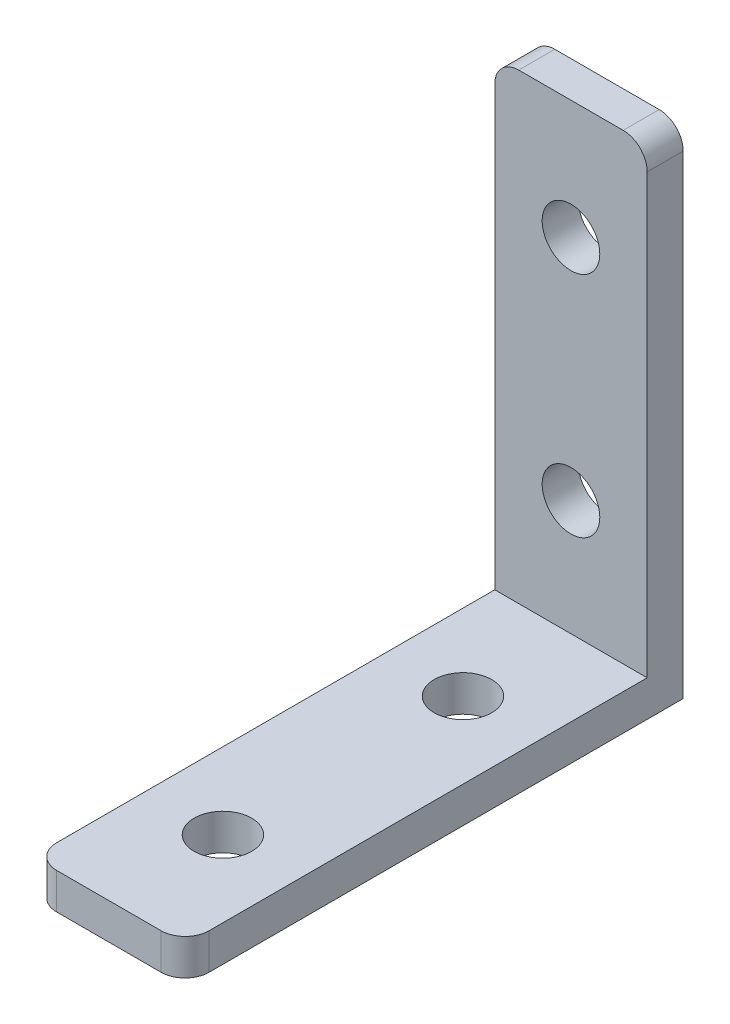
ISO-10303-21;
HEADER;
FILE_DESCRIPTION(('STEP AP214'),'2;1');
FILE_NAME('part.step','',(''),(''),'','','');
FILE_SCHEMA(('AUTOMOTIVE_DESIGN { 1 0 10303 214 1 1 1 1 }'));
ENDSEC;
DATA;
#1=APPLICATION_CONTEXT('core data for automotive mechanical design processes');
#2=APPLICATION_PROTOCOL_DEFINITION('international standard','automotive_design',2000,#1);
#3=PRODUCT_CONTEXT('',#1,'mechanical');
#4=PRODUCT('Part','Part','',(#3));
#5=PRODUCT_RELATED_PRODUCT_CATEGORY('part','',(#4));
#6=PRODUCT_DEFINITION_FORMATION('','',#4);
#7=PRODUCT_DEFINITION_CONTEXT('part definition',#1,'design');
#8=PRODUCT_DEFINITION('design','',#6,#7);
#9=PRODUCT_DEFINITION_SHAPE('','',#8);
#10=(LENGTH_UNIT() NAMED_UNIT(*) SI_UNIT(.MILLI.,.METRE.));
#11=(NAMED_UNIT(*) PLANE_ANGLE_UNIT() SI_UNIT($,.RADIAN.));
#12=(NAMED_UNIT(*) SI_UNIT($,.STERADIAN.) SOLID_ANGLE_UNIT());
#13=UNCERTAINTY_MEASURE_WITH_UNIT(LENGTH_MEASURE(1.E-05),#10,'distance_accuracy_value','');
#14=(GEOMETRIC_REPRESENTATION_CONTEXT(3) GLOBAL_UNCERTAINTY_ASSIGNED_CONTEXT((#13)) GLOBAL_UNIT_ASSIGNED_CONTEXT((#10,
#11,#12)) REPRESENTATION_CONTEXT('',''));
#15=CARTESIAN_POINT('',(0.,0.,0.));
#16=DIRECTION('',(0.,0.,1.));
#17=DIRECTION('',(1.,0.,0.));
#18=AXIS2_PLACEMENT_3D('',#15,#16,#17);
#19=CARTESIAN_POINT('',(0.,0.,3.));
#20=DIRECTION('',(0.,0.,-1.));
#21=DIRECTION('',(-1.,0.,0.));
#22=AXIS2_PLACEMENT_3D('',#19,#20,#21);
#23=PLANE('',#22);
#24=CARTESIAN_POINT('',(0.,-8.15,3.));
#25=DIRECTION('',(0.,0.,1.));
#26=DIRECTION('',(1.,0.,0.));
#27=AXIS2_PLACEMENT_3D('',#24,#25,#26);
#28=CIRCLE('',#27,2.4);
#29=CARTESIAN_POINT('',(2.4,-8.15,3.));
#30=VERTEX_POINT('',#29);
#31=EDGE_CURVE('E153',#30,#30,#28,.T.);
#32=ORIENTED_EDGE('',*,*,#31,.F.);
#33=EDGE_LOOP('',(#32));
#34=FACE_BOUND('',#33,.T.);
#35=CARTESIAN_POINT('',(0.,10.85,3.));
#36=DIRECTION('',(0.,0.,1.));
#37=DIRECTION('',(1.,0.,0.));
#38=AXIS2_PLACEMENT_3D('',#35,#36,#37);
#39=CIRCLE('',#38,2.4);
#40=CARTESIAN_POINT('',(2.4,10.85,3.));
#41=VERTEX_POINT('',#40);
#42=EDGE_CURVE('E159',#41,#41,#39,.T.);
#43=ORIENTED_EDGE('',*,*,#42,.F.);
#44=EDGE_LOOP('',(#43));
#45=FACE_BOUND('',#44,.T.);
#46=DIRECTION('',(-1.,0.,0.));
#47=VECTOR('',#46,1.);
#48=CARTESIAN_POINT('',(-6.35,20.75,3.));
#49=LINE('',#48,#47);
#50=CARTESIAN_POINT('',(4.35,20.75,3.));
#51=VERTEX_POINT('',#50);
#52=CARTESIAN_POINT('',(-4.35,20.75,3.));
#53=VERTEX_POINT('',#52);
#54=EDGE_CURVE('E128',#51,#53,#49,.T.);
#55=ORIENTED_EDGE('',*,*,#54,.T.);
#56=CARTESIAN_POINT('',(-4.35,18.75,3.));
#57=DIRECTION('',(0.,0.,-1.));
#58=DIRECTION('',(-1.,0.,0.));
#59=AXIS2_PLACEMENT_3D('',#56,#57,#58);
#60=CIRCLE('',#59,2.);
#61=CARTESIAN_POINT('',(-6.35,18.75,3.));
#62=VERTEX_POINT('',#61);
#63=EDGE_CURVE('E123',#53,#62,#60,.F.);
#64=ORIENTED_EDGE('',*,*,#63,.T.);
#65=DIRECTION('',(0.,-1.,0.));
#66=VECTOR('',#65,1.);
#67=CARTESIAN_POINT('',(-6.35,-20.75,3.));
#68=LINE('',#67,#66);
#69=CARTESIAN_POINT('',(-6.35,-17.75,3.));
#70=VERTEX_POINT('',#69);
#71=EDGE_CURVE('E115',#62,#70,#68,.T.);
#72=ORIENTED_EDGE('',*,*,#71,.T.);
#73=DIRECTION('',(-1.,0.,0.));
#74=VECTOR('',#73,1.);
#75=CARTESIAN_POINT('',(6.35,-17.75,3.));
#76=LINE('',#75,#74);
#77=CARTESIAN_POINT('',(6.35,-17.75,3.));
#78=VERTEX_POINT('',#77);
#79=EDGE_CURVE('E120',#78,#70,#76,.T.);
#80=ORIENTED_EDGE('',*,*,#79,.F.);
#81=DIRECTION('',(0.,1.,0.));
#82=VECTOR('',#81,1.);
#83=CARTESIAN_POINT('',(6.35,-20.75,3.));
#84=LINE('',#83,#82);
#85=CARTESIAN_POINT('',(6.35,18.75,3.));
#86=VERTEX_POINT('',#85);
#87=EDGE_CURVE('E165',#78,#86,#84,.T.);
#88=ORIENTED_EDGE('',*,*,#87,.T.);
#89=CARTESIAN_POINT('',(4.35,18.75,3.));
#90=DIRECTION('',(0.,0.,-1.));
#91=DIRECTION('',(-1.,0.,0.));
#92=AXIS2_PLACEMENT_3D('',#89,#90,#91);
#93=CIRCLE('',#92,2.);
#94=EDGE_CURVE('E194',#86,#51,#93,.F.);
#95=ORIENTED_EDGE('',*,*,#94,.T.);
#96=EDGE_LOOP('',(#55,#64,#72,#80,#88,#95));
#97=FACE_BOUND('',#96,.T.);
#98=ADVANCED_FACE('F37',(#34,#45,#97),#23,.F.);
#99=CARTESIAN_POINT('',(0.,0.,0.));
#100=DIRECTION('',(0.,0.,-1.));
#101=DIRECTION('',(-1.,0.,0.));
#102=AXIS2_PLACEMENT_3D('',#99,#100,#101);
#103=PLANE('',#102);
#104=CARTESIAN_POINT('',(0.,10.85,0.));
#105=DIRECTION('',(0.,0.,1.));
#106=DIRECTION('',(1.,0.,0.));
#107=AXIS2_PLACEMENT_3D('',#104,#105,#106);
#108=CIRCLE('',#107,2.4);
#109=CARTESIAN_POINT('',(2.4,10.85,0.));
#110=VERTEX_POINT('',#109);
#111=EDGE_CURVE('E156',#110,#110,#108,.T.);
#112=ORIENTED_EDGE('',*,*,#111,.T.);
#113=EDGE_LOOP('',(#112));
#114=FACE_BOUND('',#113,.T.);
#115=DIRECTION('',(0.,-1.,0.));
#116=VECTOR('',#115,1.);
#117=CARTESIAN_POINT('',(-6.35,-20.75,0.));
#118=LINE('',#117,#116);
#119=CARTESIAN_POINT('',(-6.35,18.75,0.));
#120=VERTEX_POINT('',#119);
#121=CARTESIAN_POINT('',(-6.35,-20.75,0.));
#122=VERTEX_POINT('',#121);
#123=EDGE_CURVE('E174',#120,#122,#118,.T.);
#124=ORIENTED_EDGE('',*,*,#123,.F.);
#125=CARTESIAN_POINT('',(-4.35,18.75,0.));
#126=DIRECTION('',(0.,0.,-1.));
#127=DIRECTION('',(-1.,0.,0.));
#128=AXIS2_PLACEMENT_3D('',#125,#126,#127);
#129=CIRCLE('',#128,2.);
#130=CARTESIAN_POINT('',(-4.35,20.75,0.));
#131=VERTEX_POINT('',#130);
#132=EDGE_CURVE('E187',#120,#131,#129,.T.);
#133=ORIENTED_EDGE('',*,*,#132,.T.);
#134=DIRECTION('',(-1.,0.,0.));
#135=VECTOR('',#134,1.);
#136=CARTESIAN_POINT('',(-6.35,20.75,0.));
#137=LINE('',#136,#135);
#138=CARTESIAN_POINT('',(4.35,20.75,0.));
#139=VERTEX_POINT('',#138);
#140=EDGE_CURVE('E171',#139,#131,#137,.T.);
#141=ORIENTED_EDGE('',*,*,#140,.F.);
#142=CARTESIAN_POINT('',(4.35,18.75,0.));
#143=DIRECTION('',(0.,0.,-1.));
#144=DIRECTION('',(-1.,0.,0.));
#145=AXIS2_PLACEMENT_3D('',#142,#143,#144);
#146=CIRCLE('',#145,2.);
#147=CARTESIAN_POINT('',(6.35,18.75,0.));
#148=VERTEX_POINT('',#147);
#149=EDGE_CURVE('E185',#139,#148,#146,.T.);
#150=ORIENTED_EDGE('',*,*,#149,.T.);
#151=DIRECTION('',(0.,1.,0.));
#152=VECTOR('',#151,1.);
#153=CARTESIAN_POINT('',(6.35,-20.75,0.));
#154=LINE('',#153,#152);
#155=CARTESIAN_POINT('',(6.35,-20.75,0.));
#156=VERTEX_POINT('',#155);
#157=EDGE_CURVE('E162',#156,#148,#154,.T.);
#158=ORIENTED_EDGE('',*,*,#157,.F.);
#159=DIRECTION('',(1.,0.,0.));
#160=VECTOR('',#159,1.);
#161=CARTESIAN_POINT('',(-6.35,-20.75,0.));
#162=LINE('',#161,#160);
#163=EDGE_CURVE('E167',#122,#156,#162,.T.);
#164=ORIENTED_EDGE('',*,*,#163,.F.);
#165=EDGE_LOOP('',(#124,#133,#141,#150,#158,#164));
#166=FACE_BOUND('',#165,.T.);
#167=CARTESIAN_POINT('',(0.,-8.15,0.));
#168=DIRECTION('',(0.,0.,1.));
#169=DIRECTION('',(1.,0.,0.));
#170=AXIS2_PLACEMENT_3D('',#167,#168,#169);
#171=CIRCLE('',#170,2.4);
#172=CARTESIAN_POINT('',(2.4,-8.15,0.));
#173=VERTEX_POINT('',#172);
#174=EDGE_CURVE('E151',#173,#173,#171,.T.);
#175=ORIENTED_EDGE('',*,*,#174,.T.);
#176=EDGE_LOOP('',(#175));
#177=FACE_BOUND('',#176,.T.);
#178=ADVANCED_FACE('F231',(#114,#166,#177),#103,.T.);
#179=CARTESIAN_POINT('',(6.35,-20.75,3.));
#180=DIRECTION('',(-1.,0.,0.));
#181=DIRECTION('',(0.,0.,1.));
#182=AXIS2_PLACEMENT_3D('',#179,#180,#181);
#183=PLANE('',#182);
#184=ORIENTED_EDGE('',*,*,#157,.T.);
#185=DIRECTION('',(0.,0.,-1.));
#186=VECTOR('',#185,1.);
#187=CARTESIAN_POINT('',(6.35,18.75,3.));
#188=LINE('',#187,#186);
#189=EDGE_CURVE('E200',#148,#86,#188,.F.);
#190=ORIENTED_EDGE('',*,*,#189,.T.);
#191=ORIENTED_EDGE('',*,*,#87,.F.);
#192=DIRECTION('',(0.,0.,-1.));
#193=VECTOR('',#192,1.);
#194=CARTESIAN_POINT('',(6.35,-17.75,41.5));
#195=LINE('',#194,#193);
#196=CARTESIAN_POINT('',(6.35,-17.75,39.5));
#197=VERTEX_POINT('',#196);
#198=EDGE_CURVE('E137',#197,#78,#195,.T.);
#199=ORIENTED_EDGE('',*,*,#198,.F.);
#200=DIRECTION('',(0.,-1.,0.));
#201=VECTOR('',#200,1.);
#202=CARTESIAN_POINT('',(6.35,-20.75,39.5));
#203=LINE('',#202,#201);
#204=CARTESIAN_POINT('',(6.35,-20.75,39.5));
#205=VERTEX_POINT('',#204);
#206=EDGE_CURVE('E197',#197,#205,#203,.T.);
#207=ORIENTED_EDGE('',*,*,#206,.T.);
#208=DIRECTION('',(0.,0.,-1.));
#209=VECTOR('',#208,1.);
#210=CARTESIAN_POINT('',(6.35,-20.75,3.));
#211=LINE('',#210,#209);
#212=EDGE_CURVE('E127',#205,#156,#211,.T.);
#213=ORIENTED_EDGE('',*,*,#212,.T.);
#214=EDGE_LOOP('',(#184,#190,#191,#199,#207,#213));
#215=FACE_BOUND('',#214,.T.);
#216=ADVANCED_FACE('F214',(#215),#183,.F.);
#217=CARTESIAN_POINT('',(-6.35,20.75,3.));
#218=DIRECTION('',(0.,-1.,0.));
#219=DIRECTION('',(0.,0.,-1.));
#220=AXIS2_PLACEMENT_3D('',#217,#218,#219);
#221=PLANE('',#220);
#222=ORIENTED_EDGE('',*,*,#140,.T.);
#223=DIRECTION('',(0.,0.,-1.));
#224=VECTOR('',#223,1.);
#225=CARTESIAN_POINT('',(-4.35,20.75,3.));
#226=LINE('',#225,#224);
#227=EDGE_CURVE('E192',#131,#53,#226,.F.);
#228=ORIENTED_EDGE('',*,*,#227,.T.);
#229=ORIENTED_EDGE('',*,*,#54,.F.);
#230=DIRECTION('',(0.,0.,-1.));
#231=VECTOR('',#230,1.);
#232=CARTESIAN_POINT('',(4.35,20.75,3.));
#233=LINE('',#232,#231);
#234=EDGE_CURVE('E189',#51,#139,#233,.T.);
#235=ORIENTED_EDGE('',*,*,#234,.T.);
#236=EDGE_LOOP('',(#222,#228,#229,#235));
#237=FACE_BOUND('',#236,.T.);
#238=ADVANCED_FACE('F250',(#237),#221,.F.);
#239=CARTESIAN_POINT('',(-6.35,-20.75,3.));
#240=DIRECTION('',(1.,0.,0.));
#241=DIRECTION('',(0.,0.,-1.));
#242=AXIS2_PLACEMENT_3D('',#239,#240,#241);
#243=PLANE('',#242);
#244=ORIENTED_EDGE('',*,*,#71,.F.);
#245=DIRECTION('',(0.,0.,-1.));
#246=VECTOR('',#245,1.);
#247=CARTESIAN_POINT('',(-6.35,18.75,3.));
#248=LINE('',#247,#246);
#249=EDGE_CURVE('E183',#62,#120,#248,.T.);
#250=ORIENTED_EDGE('',*,*,#249,.T.);
#251=ORIENTED_EDGE('',*,*,#123,.T.);
#252=DIRECTION('',(0.,0.,-1.));
#253=VECTOR('',#252,1.);
#254=CARTESIAN_POINT('',(-6.35,-20.75,3.));
#255=LINE('',#254,#253);
#256=CARTESIAN_POINT('',(-6.35,-20.75,39.5));
#257=VERTEX_POINT('',#256);
#258=EDGE_CURVE('E180',#257,#122,#255,.T.);
#259=ORIENTED_EDGE('',*,*,#258,.F.);
#260=DIRECTION('',(0.,-1.,0.));
#261=VECTOR('',#260,1.);
#262=CARTESIAN_POINT('',(-6.35,-20.75,39.5));
#263=LINE('',#262,#261);
#264=CARTESIAN_POINT('',(-6.35,-17.75,39.5));
#265=VERTEX_POINT('',#264);
#266=EDGE_CURVE('E134',#257,#265,#263,.F.);
#267=ORIENTED_EDGE('',*,*,#266,.T.);
#268=DIRECTION('',(0.,0.,-1.));
#269=VECTOR('',#268,1.);
#270=CARTESIAN_POINT('',(-6.35,-17.75,41.5));
#271=LINE('',#270,#269);
#272=EDGE_CURVE('E131',#265,#70,#271,.T.);
#273=ORIENTED_EDGE('',*,*,#272,.T.);
#274=EDGE_LOOP('',(#244,#250,#251,#259,#267,#273));
#275=FACE_BOUND('',#274,.T.);
#276=ADVANCED_FACE('F132',(#275),#243,.F.);
#277=CARTESIAN_POINT('',(-6.35,-20.75,3.));
#278=DIRECTION('',(0.,1.,0.));
#279=DIRECTION('',(0.,0.,1.));
#280=AXIS2_PLACEMENT_3D('',#277,#278,#279);
#281=PLANE('',#280);
#282=CARTESIAN_POINT('',(0.,-20.75,12.));
#283=DIRECTION('',(0.,1.,0.));
#284=DIRECTION('',(0.,0.,1.));
#285=AXIS2_PLACEMENT_3D('',#282,#283,#284);
#286=CIRCLE('',#285,2.4);
#287=CARTESIAN_POINT('',(0.,-20.75,14.4));
#288=VERTEX_POINT('',#287);
#289=EDGE_CURVE('E143',#288,#288,#286,.T.);
#290=ORIENTED_EDGE('',*,*,#289,.T.);
#291=EDGE_LOOP('',(#290));
#292=FACE_BOUND('',#291,.T.);
#293=CARTESIAN_POINT('',(0.,-20.75,32.));
#294=DIRECTION('',(0.,1.,0.));
#295=DIRECTION('',(0.,0.,1.));
#296=AXIS2_PLACEMENT_3D('',#293,#294,#295);
#297=CIRCLE('',#296,2.4);
#298=CARTESIAN_POINT('',(0.,-20.75,34.4));
#299=VERTEX_POINT('',#298);
#300=EDGE_CURVE('E147',#299,#299,#297,.T.);
#301=ORIENTED_EDGE('',*,*,#300,.T.);
#302=EDGE_LOOP('',(#301));
#303=FACE_BOUND('',#302,.T.);
#304=DIRECTION('',(-1.,0.,0.));
#305=VECTOR('',#304,1.);
#306=CARTESIAN_POINT('',(6.35,-20.75,41.5));
#307=LINE('',#306,#305);
#308=CARTESIAN_POINT('',(4.35,-20.75,41.5));
#309=VERTEX_POINT('',#308);
#310=CARTESIAN_POINT('',(-4.35,-20.75,41.5));
#311=VERTEX_POINT('',#310);
#312=EDGE_CURVE('E142',#309,#311,#307,.T.);
#313=ORIENTED_EDGE('',*,*,#312,.T.);
#314=CARTESIAN_POINT('',(-4.35,-20.75,39.5));
#315=DIRECTION('',(0.,1.,0.));
#316=DIRECTION('',(0.,0.,1.));
#317=AXIS2_PLACEMENT_3D('',#314,#315,#316);
#318=CIRCLE('',#317,2.);
#319=EDGE_CURVE('E52',#311,#257,#318,.F.);
#320=ORIENTED_EDGE('',*,*,#319,.T.);
#321=ORIENTED_EDGE('',*,*,#258,.T.);
#322=ORIENTED_EDGE('',*,*,#163,.T.);
#323=ORIENTED_EDGE('',*,*,#212,.F.);
#324=CARTESIAN_POINT('',(4.35,-20.75,39.5));
#325=DIRECTION('',(0.,1.,0.));
#326=DIRECTION('',(0.,0.,1.));
#327=AXIS2_PLACEMENT_3D('',#324,#325,#326);
#328=CIRCLE('',#327,2.);
#329=EDGE_CURVE('E60',#205,#309,#328,.F.);
#330=ORIENTED_EDGE('',*,*,#329,.T.);
#331=EDGE_LOOP('',(#313,#320,#321,#322,#323,#330));
#332=FACE_BOUND('',#331,.T.);
#333=ADVANCED_FACE('F217',(#292,#303,#332),#281,.F.);
#334=CARTESIAN_POINT('',(0.,10.85,3.));
#335=DIRECTION('',(0.,0.,-1.));
#336=DIRECTION('',(-1.,0.,0.));
#337=AXIS2_PLACEMENT_3D('',#334,#335,#336);
#338=CYLINDRICAL_SURFACE('',#337,2.4);
#339=ORIENTED_EDGE('',*,*,#42,.T.);
#340=EDGE_LOOP('',(#339));
#341=FACE_BOUND('',#340,.T.);
#342=ORIENTED_EDGE('',*,*,#111,.F.);
#343=EDGE_LOOP('',(#342));
#344=FACE_BOUND('',#343,.T.);
#345=ADVANCED_FACE('F242',(#341,#344),#338,.F.);
#346=CARTESIAN_POINT('',(0.,-8.15,3.));
#347=DIRECTION('',(0.,0.,-1.));
#348=DIRECTION('',(-1.,0.,0.));
#349=AXIS2_PLACEMENT_3D('',#346,#347,#348);
#350=CYLINDRICAL_SURFACE('',#349,2.4);
#351=ORIENTED_EDGE('',*,*,#31,.T.);
#352=EDGE_LOOP('',(#351));
#353=FACE_BOUND('',#352,.T.);
#354=ORIENTED_EDGE('',*,*,#174,.F.);
#355=EDGE_LOOP('',(#354));
#356=FACE_BOUND('',#355,.T.);
#357=ADVANCED_FACE('F276',(#353,#356),#350,.F.);
#358=CARTESIAN_POINT('',(6.35,-17.75,41.5));
#359=DIRECTION('',(0.,-1.,0.));
#360=DIRECTION('',(0.,0.,-1.));
#361=AXIS2_PLACEMENT_3D('',#358,#359,#360);
#362=PLANE('',#361);
#363=CARTESIAN_POINT('',(0.,-17.75,12.));
#364=DIRECTION('',(0.,1.,0.));
#365=DIRECTION('',(0.,0.,1.));
#366=AXIS2_PLACEMENT_3D('',#363,#364,#365);
#367=CIRCLE('',#366,2.4);
#368=CARTESIAN_POINT('',(0.,-17.75,14.4));
#369=VERTEX_POINT('',#368);
#370=EDGE_CURVE('E300',#369,#369,#367,.T.);
#371=ORIENTED_EDGE('',*,*,#370,.F.);
#372=EDGE_LOOP('',(#371));
#373=FACE_BOUND('',#372,.T.);
#374=CARTESIAN_POINT('',(0.,-17.75,32.));
#375=DIRECTION('',(0.,1.,0.));
#376=DIRECTION('',(0.,0.,1.));
#377=AXIS2_PLACEMENT_3D('',#374,#375,#376);
#378=CIRCLE('',#377,2.4);
#379=CARTESIAN_POINT('',(0.,-17.75,34.4));
#380=VERTEX_POINT('',#379);
#381=EDGE_CURVE('E296',#380,#380,#378,.T.);
#382=ORIENTED_EDGE('',*,*,#381,.F.);
#383=EDGE_LOOP('',(#382));
#384=FACE_BOUND('',#383,.T.);
#385=ORIENTED_EDGE('',*,*,#272,.F.);
#386=CARTESIAN_POINT('',(-4.35,-17.75,39.5));
#387=DIRECTION('',(0.,-1.,0.));
#388=DIRECTION('',(0.,0.,-1.));
#389=AXIS2_PLACEMENT_3D('',#386,#387,#388);
#390=CIRCLE('',#389,2.);
#391=CARTESIAN_POINT('',(-4.35,-17.75,41.5));
#392=VERTEX_POINT('',#391);
#393=EDGE_CURVE('E11',#265,#392,#390,.F.);
#394=ORIENTED_EDGE('',*,*,#393,.T.);
#395=DIRECTION('',(-1.,0.,0.));
#396=VECTOR('',#395,1.);
#397=CARTESIAN_POINT('',(6.35,-17.75,41.5));
#398=LINE('',#397,#396);
#399=CARTESIAN_POINT('',(4.35,-17.75,41.5));
#400=VERTEX_POINT('',#399);
#401=EDGE_CURVE('E138',#400,#392,#398,.T.);
#402=ORIENTED_EDGE('',*,*,#401,.F.);
#403=CARTESIAN_POINT('',(4.35,-17.75,39.5));
#404=DIRECTION('',(0.,-1.,0.));
#405=DIRECTION('',(0.,0.,-1.));
#406=AXIS2_PLACEMENT_3D('',#403,#404,#405);
#407=CIRCLE('',#406,2.);
#408=EDGE_CURVE('E45',#400,#197,#407,.F.);
#409=ORIENTED_EDGE('',*,*,#408,.T.);
#410=ORIENTED_EDGE('',*,*,#198,.T.);
#411=ORIENTED_EDGE('',*,*,#79,.T.);
#412=EDGE_LOOP('',(#385,#394,#402,#409,#410,#411));
#413=FACE_BOUND('',#412,.T.);
#414=ADVANCED_FACE('F140',(#373,#384,#413),#362,.F.);
#415=CARTESIAN_POINT('',(0.,0.,41.5));
#416=DIRECTION('',(0.,0.,-1.));
#417=DIRECTION('',(-1.,0.,0.));
#418=AXIS2_PLACEMENT_3D('',#415,#416,#417);
#419=PLANE('',#418);
#420=ORIENTED_EDGE('',*,*,#401,.T.);
#421=DIRECTION('',(0.,-1.,0.));
#422=VECTOR('',#421,1.);
#423=CARTESIAN_POINT('',(-4.35,0.,41.5));
#424=LINE('',#423,#422);
#425=EDGE_CURVE('E204',#392,#311,#424,.T.);
#426=ORIENTED_EDGE('',*,*,#425,.T.);
#427=ORIENTED_EDGE('',*,*,#312,.F.);
#428=DIRECTION('',(0.,-1.,0.));
#429=VECTOR('',#428,1.);
#430=CARTESIAN_POINT('',(4.35,0.,41.5));
#431=LINE('',#430,#429);
#432=EDGE_CURVE('E202',#309,#400,#431,.F.);
#433=ORIENTED_EDGE('',*,*,#432,.T.);
#434=EDGE_LOOP('',(#420,#426,#427,#433));
#435=FACE_BOUND('',#434,.T.);
#436=ADVANCED_FACE('F216',(#435),#419,.F.);
#437=CARTESIAN_POINT('',(0.,-59.25,32.));
#438=DIRECTION('',(0.,1.,0.));
#439=DIRECTION('',(0.,0.,1.));
#440=AXIS2_PLACEMENT_3D('',#437,#438,#439);
#441=CYLINDRICAL_SURFACE('',#440,2.4);
#442=ORIENTED_EDGE('',*,*,#381,.T.);
#443=EDGE_LOOP('',(#442));
#444=FACE_BOUND('',#443,.T.);
#445=ORIENTED_EDGE('',*,*,#300,.F.);
#446=EDGE_LOOP('',(#445));
#447=FACE_BOUND('',#446,.T.);
#448=ADVANCED_FACE('F262',(#444,#447),#441,.F.);
#449=CARTESIAN_POINT('',(0.,-59.25,12.));
#450=DIRECTION('',(0.,1.,0.));
#451=DIRECTION('',(0.,0.,1.));
#452=AXIS2_PLACEMENT_3D('',#449,#450,#451);
#453=CYLINDRICAL_SURFACE('',#452,2.4);
#454=ORIENTED_EDGE('',*,*,#370,.T.);
#455=EDGE_LOOP('',(#454));
#456=FACE_BOUND('',#455,.T.);
#457=ORIENTED_EDGE('',*,*,#289,.F.);
#458=EDGE_LOOP('',(#457));
#459=FACE_BOUND('',#458,.T.);
#460=ADVANCED_FACE('F257',(#456,#459),#453,.F.);
#461=CARTESIAN_POINT('',(-4.35,18.75,3.));
#462=DIRECTION('',(0.,0.,-1.));
#463=DIRECTION('',(-1.,0.,0.));
#464=AXIS2_PLACEMENT_3D('',#461,#462,#463);
#465=CYLINDRICAL_SURFACE('',#464,2.);
#466=ORIENTED_EDGE('',*,*,#63,.F.);
#467=ORIENTED_EDGE('',*,*,#227,.F.);
#468=ORIENTED_EDGE('',*,*,#132,.F.);
#469=ORIENTED_EDGE('',*,*,#249,.F.);
#470=EDGE_LOOP('',(#466,#467,#468,#469));
#471=FACE_BOUND('',#470,.T.);
#472=ADVANCED_FACE('F227',(#471),#465,.T.);
#473=CARTESIAN_POINT('',(4.35,18.75,3.));
#474=DIRECTION('',(0.,0.,-1.));
#475=DIRECTION('',(-1.,0.,0.));
#476=AXIS2_PLACEMENT_3D('',#473,#474,#475);
#477=CYLINDRICAL_SURFACE('',#476,2.);
#478=ORIENTED_EDGE('',*,*,#94,.F.);
#479=ORIENTED_EDGE('',*,*,#189,.F.);
#480=ORIENTED_EDGE('',*,*,#149,.F.);
#481=ORIENTED_EDGE('',*,*,#234,.F.);
#482=EDGE_LOOP('',(#478,#479,#480,#481));
#483=FACE_BOUND('',#482,.T.);
#484=ADVANCED_FACE('F222',(#483),#477,.T.);
#485=CARTESIAN_POINT('',(-4.35,0.,39.5));
#486=DIRECTION('',(0.,-1.,0.));
#487=DIRECTION('',(0.,0.,-1.));
#488=AXIS2_PLACEMENT_3D('',#485,#486,#487);
#489=CYLINDRICAL_SURFACE('',#488,2.);
#490=ORIENTED_EDGE('',*,*,#393,.F.);
#491=ORIENTED_EDGE('',*,*,#266,.F.);
#492=ORIENTED_EDGE('',*,*,#319,.F.);
#493=ORIENTED_EDGE('',*,*,#425,.F.);
#494=EDGE_LOOP('',(#490,#491,#492,#493));
#495=FACE_BOUND('',#494,.T.);
#496=ADVANCED_FACE('F220',(#495),#489,.T.);
#497=CARTESIAN_POINT('',(4.35,-20.75,39.5));
#498=DIRECTION('',(0.,-1.,0.));
#499=DIRECTION('',(0.,0.,-1.));
#500=AXIS2_PLACEMENT_3D('',#497,#498,#499);
#501=CYLINDRICAL_SURFACE('',#500,2.);
#502=ORIENTED_EDGE('',*,*,#408,.F.);
#503=ORIENTED_EDGE('',*,*,#432,.F.);
#504=ORIENTED_EDGE('',*,*,#329,.F.);
#505=ORIENTED_EDGE('',*,*,#206,.F.);
#506=EDGE_LOOP('',(#502,#503,#504,#505));
#507=FACE_BOUND('',#506,.T.);
#508=ADVANCED_FACE('F39',(#507),#501,.T.);
#509=CLOSED_SHELL('',(#98,#178,#216,#238,#276,#333,#345,#357,#414,#436,#448,#460,#472,#484,#496,#508));
#510=MANIFOLD_SOLID_BREP('B2',#509);
#511=ADVANCED_BREP_SHAPE_REPRESENTATION('',(#18,#510),#14);
#512=SHAPE_DEFINITION_REPRESENTATION(#9,#511);
ENDSEC;
END-ISO-10303-21;
